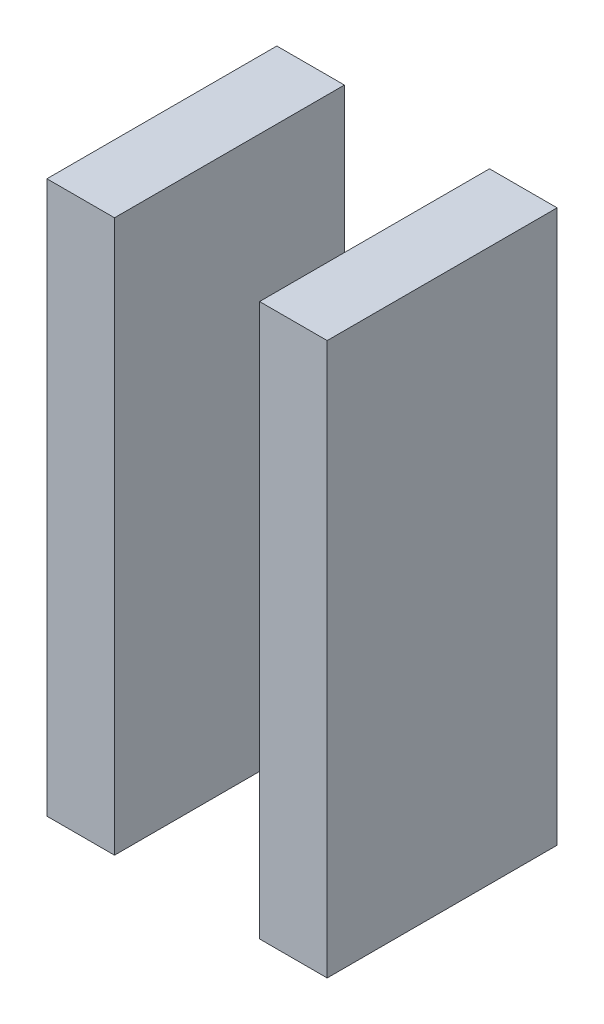
ISO-10303-21;
HEADER;
FILE_DESCRIPTION(('STEP AP214'),'2;1');
FILE_NAME('part.step','',(''),(''),'','','');
FILE_SCHEMA(('AUTOMOTIVE_DESIGN { 1 0 10303 214 1 1 1 1 }'));
ENDSEC;
DATA;
#1=APPLICATION_CONTEXT('core data for automotive mechanical design processes');
#2=APPLICATION_PROTOCOL_DEFINITION('international standard','automotive_design',2000,#1);
#3=PRODUCT_CONTEXT('',#1,'mechanical');
#4=PRODUCT('Part','Part','',(#3));
#5=PRODUCT_RELATED_PRODUCT_CATEGORY('part','',(#4));
#6=PRODUCT_DEFINITION_FORMATION('','',#4);
#7=PRODUCT_DEFINITION_CONTEXT('part definition',#1,'design');
#8=PRODUCT_DEFINITION('design','',#6,#7);
#9=PRODUCT_DEFINITION_SHAPE('','',#8);
#10=(LENGTH_UNIT() NAMED_UNIT(*) SI_UNIT(.MILLI.,.METRE.));
#11=(NAMED_UNIT(*) PLANE_ANGLE_UNIT() SI_UNIT($,.RADIAN.));
#12=(NAMED_UNIT(*) SI_UNIT($,.STERADIAN.) SOLID_ANGLE_UNIT());
#13=UNCERTAINTY_MEASURE_WITH_UNIT(LENGTH_MEASURE(1.E-05),#10,'distance_accuracy_value','');
#14=(GEOMETRIC_REPRESENTATION_CONTEXT(3) GLOBAL_UNCERTAINTY_ASSIGNED_CONTEXT((#13)) GLOBAL_UNIT_ASSIGNED_CONTEXT((#10,
#11,#12)) REPRESENTATION_CONTEXT('',''));
#15=CARTESIAN_POINT('',(0.,0.,0.));
#16=DIRECTION('',(0.,0.,1.));
#17=DIRECTION('',(1.,0.,0.));
#18=AXIS2_PLACEMENT_3D('',#15,#16,#17);
#19=CARTESIAN_POINT('',(204.22,-34.095,11.));
#20=DIRECTION('',(0.,-1.,0.));
#21=DIRECTION('',(0.,0.,-1.));
#22=AXIS2_PLACEMENT_3D('',#19,#20,#21);
#23=PLANE('',#22);
#24=DIRECTION('',(-1.,0.,0.));
#25=VECTOR('',#24,1.);
#26=CARTESIAN_POINT('',(204.22,-34.095,1.));
#27=LINE('',#26,#25);
#28=CARTESIAN_POINT('',(204.22,-34.095,1.));
#29=VERTEX_POINT('',#28);
#30=CARTESIAN_POINT('',(201.28,-34.095,1.));
#31=VERTEX_POINT('',#30);
#32=EDGE_CURVE('E12',#29,#31,#27,.T.);
#33=ORIENTED_EDGE('',*,*,#32,.T.);
#34=DIRECTION('',(0.,0.,-1.));
#35=VECTOR('',#34,1.);
#36=CARTESIAN_POINT('',(201.28,-34.095,11.));
#37=LINE('',#36,#35);
#38=CARTESIAN_POINT('',(201.28,-34.095,11.));
#39=VERTEX_POINT('',#38);
#40=EDGE_CURVE('E118',#39,#31,#37,.T.);
#41=ORIENTED_EDGE('',*,*,#40,.F.);
#42=DIRECTION('',(-1.,0.,0.));
#43=VECTOR('',#42,1.);
#44=CARTESIAN_POINT('',(204.22,-34.095,11.));
#45=LINE('',#44,#43);
#46=CARTESIAN_POINT('',(204.22,-34.095,11.));
#47=VERTEX_POINT('',#46);
#48=EDGE_CURVE('E51',#47,#39,#45,.T.);
#49=ORIENTED_EDGE('',*,*,#48,.F.);
#50=DIRECTION('',(0.,0.,-1.));
#51=VECTOR('',#50,1.);
#52=CARTESIAN_POINT('',(204.22,-34.095,11.));
#53=LINE('',#52,#51);
#54=EDGE_CURVE('E106',#47,#29,#53,.T.);
#55=ORIENTED_EDGE('',*,*,#54,.T.);
#56=EDGE_LOOP('',(#33,#41,#49,#55));
#57=FACE_BOUND('',#56,.T.);
#58=ADVANCED_FACE('F47',(#57),#23,.F.);
#59=CARTESIAN_POINT('',(201.28,-34.095,11.));
#60=DIRECTION('',(1.,0.,0.));
#61=DIRECTION('',(0.,0.,-1.));
#62=AXIS2_PLACEMENT_3D('',#59,#60,#61);
#63=PLANE('',#62);
#64=DIRECTION('',(0.,-1.,0.));
#65=VECTOR('',#64,1.);
#66=CARTESIAN_POINT('',(201.28,-34.095,1.));
#67=LINE('',#66,#65);
#68=CARTESIAN_POINT('',(201.28,-58.105,1.));
#69=VERTEX_POINT('',#68);
#70=EDGE_CURVE('E57',#31,#69,#67,.T.);
#71=ORIENTED_EDGE('',*,*,#70,.T.);
#72=DIRECTION('',(0.,0.,-1.));
#73=VECTOR('',#72,1.);
#74=CARTESIAN_POINT('',(201.28,-58.105,11.));
#75=LINE('',#74,#73);
#76=CARTESIAN_POINT('',(201.28,-58.105,11.));
#77=VERTEX_POINT('',#76);
#78=EDGE_CURVE('E102',#77,#69,#75,.T.);
#79=ORIENTED_EDGE('',*,*,#78,.F.);
#80=DIRECTION('',(0.,-1.,0.));
#81=VECTOR('',#80,1.);
#82=CARTESIAN_POINT('',(201.28,-34.095,11.));
#83=LINE('',#82,#81);
#84=EDGE_CURVE('E81',#39,#77,#83,.T.);
#85=ORIENTED_EDGE('',*,*,#84,.F.);
#86=ORIENTED_EDGE('',*,*,#40,.T.);
#87=EDGE_LOOP('',(#71,#79,#85,#86));
#88=FACE_BOUND('',#87,.T.);
#89=ADVANCED_FACE('F121',(#88),#63,.F.);
#90=CARTESIAN_POINT('',(204.22,-58.105,11.));
#91=DIRECTION('',(0.,1.,0.));
#92=DIRECTION('',(0.,0.,1.));
#93=AXIS2_PLACEMENT_3D('',#90,#91,#92);
#94=PLANE('',#93);
#95=DIRECTION('',(1.,0.,0.));
#96=VECTOR('',#95,1.);
#97=CARTESIAN_POINT('',(204.22,-58.105,1.));
#98=LINE('',#97,#96);
#99=CARTESIAN_POINT('',(204.22,-58.105,1.));
#100=VERTEX_POINT('',#99);
#101=EDGE_CURVE('E97',#69,#100,#98,.T.);
#102=ORIENTED_EDGE('',*,*,#101,.T.);
#103=DIRECTION('',(0.,0.,-1.));
#104=VECTOR('',#103,1.);
#105=CARTESIAN_POINT('',(204.22,-58.105,11.));
#106=LINE('',#105,#104);
#107=CARTESIAN_POINT('',(204.22,-58.105,11.));
#108=VERTEX_POINT('',#107);
#109=EDGE_CURVE('E100',#108,#100,#106,.T.);
#110=ORIENTED_EDGE('',*,*,#109,.F.);
#111=DIRECTION('',(1.,0.,0.));
#112=VECTOR('',#111,1.);
#113=CARTESIAN_POINT('',(204.22,-58.105,11.));
#114=LINE('',#113,#112);
#115=EDGE_CURVE('E114',#77,#108,#114,.T.);
#116=ORIENTED_EDGE('',*,*,#115,.F.);
#117=ORIENTED_EDGE('',*,*,#78,.T.);
#118=EDGE_LOOP('',(#102,#110,#116,#117));
#119=FACE_BOUND('',#118,.T.);
#120=ADVANCED_FACE('F98',(#119),#94,.F.);
#121=CARTESIAN_POINT('',(204.22,-34.095,11.));
#122=DIRECTION('',(-1.,0.,0.));
#123=DIRECTION('',(0.,0.,1.));
#124=AXIS2_PLACEMENT_3D('',#121,#122,#123);
#125=PLANE('',#124);
#126=DIRECTION('',(0.,1.,0.));
#127=VECTOR('',#126,1.);
#128=CARTESIAN_POINT('',(204.22,-34.095,1.));
#129=LINE('',#128,#127);
#130=EDGE_CURVE('E91',#100,#29,#129,.T.);
#131=ORIENTED_EDGE('',*,*,#130,.T.);
#132=ORIENTED_EDGE('',*,*,#54,.F.);
#133=DIRECTION('',(0.,1.,0.));
#134=VECTOR('',#133,1.);
#135=CARTESIAN_POINT('',(204.22,-34.095,11.));
#136=LINE('',#135,#134);
#137=EDGE_CURVE('E105',#108,#47,#136,.T.);
#138=ORIENTED_EDGE('',*,*,#137,.F.);
#139=ORIENTED_EDGE('',*,*,#109,.T.);
#140=EDGE_LOOP('',(#131,#132,#138,#139));
#141=FACE_BOUND('',#140,.T.);
#142=ADVANCED_FACE('F104',(#141),#125,.F.);
#143=CARTESIAN_POINT('',(0.,0.,11.));
#144=DIRECTION('',(0.,0.,1.));
#145=DIRECTION('',(1.,0.,0.));
#146=AXIS2_PLACEMENT_3D('',#143,#144,#145);
#147=PLANE('',#146);
#148=ORIENTED_EDGE('',*,*,#48,.T.);
#149=ORIENTED_EDGE('',*,*,#84,.T.);
#150=ORIENTED_EDGE('',*,*,#115,.T.);
#151=ORIENTED_EDGE('',*,*,#137,.T.);
#152=EDGE_LOOP('',(#148,#149,#150,#151));
#153=FACE_BOUND('',#152,.T.);
#154=ADVANCED_FACE('F49',(#153),#147,.T.);
#155=CARTESIAN_POINT('',(0.,0.,1.));
#156=DIRECTION('',(0.,0.,1.));
#157=DIRECTION('',(1.,0.,0.));
#158=AXIS2_PLACEMENT_3D('',#155,#156,#157);
#159=PLANE('',#158);
#160=ORIENTED_EDGE('',*,*,#32,.F.);
#161=ORIENTED_EDGE('',*,*,#130,.F.);
#162=ORIENTED_EDGE('',*,*,#101,.F.);
#163=ORIENTED_EDGE('',*,*,#70,.F.);
#164=EDGE_LOOP('',(#160,#161,#162,#163));
#165=FACE_BOUND('',#164,.T.);
#166=ADVANCED_FACE('F108',(#165),#159,.F.);
#167=CLOSED_SHELL('',(#58,#89,#120,#142,#154,#166));
#168=MANIFOLD_SOLID_BREP('B2',#167);
#169=CARTESIAN_POINT('',(192.03,-34.095,11.));
#170=DIRECTION('',(1.,0.,0.));
#171=DIRECTION('',(0.,0.,-1.));
#172=AXIS2_PLACEMENT_3D('',#169,#170,#171);
#173=PLANE('',#172);
#174=DIRECTION('',(0.,-1.,0.));
#175=VECTOR('',#174,1.);
#176=CARTESIAN_POINT('',(192.03,-34.095,1.));
#177=LINE('',#176,#175);
#178=CARTESIAN_POINT('',(192.03,-34.095,1.));
#179=VERTEX_POINT('',#178);
#180=CARTESIAN_POINT('',(192.03,-58.105,1.));
#181=VERTEX_POINT('',#180);
#182=EDGE_CURVE('E246',#179,#181,#177,.T.);
#183=ORIENTED_EDGE('',*,*,#182,.T.);
#184=DIRECTION('',(0.,0.,-1.));
#185=VECTOR('',#184,1.);
#186=CARTESIAN_POINT('',(192.03,-58.105,11.));
#187=LINE('',#186,#185);
#188=CARTESIAN_POINT('',(192.03,-58.105,11.));
#189=VERTEX_POINT('',#188);
#190=EDGE_CURVE('E45',#189,#181,#187,.T.);
#191=ORIENTED_EDGE('',*,*,#190,.F.);
#192=DIRECTION('',(0.,-1.,0.));
#193=VECTOR('',#192,1.);
#194=CARTESIAN_POINT('',(192.03,-34.095,11.));
#195=LINE('',#194,#193);
#196=CARTESIAN_POINT('',(192.03,-34.095,11.));
#197=VERTEX_POINT('',#196);
#198=EDGE_CURVE('E234',#197,#189,#195,.T.);
#199=ORIENTED_EDGE('',*,*,#198,.F.);
#200=DIRECTION('',(0.,0.,-1.));
#201=VECTOR('',#200,1.);
#202=CARTESIAN_POINT('',(192.03,-34.095,11.));
#203=LINE('',#202,#201);
#204=EDGE_CURVE('E242',#197,#179,#203,.T.);
#205=ORIENTED_EDGE('',*,*,#204,.T.);
#206=EDGE_LOOP('',(#183,#191,#199,#205));
#207=FACE_BOUND('',#206,.T.);
#208=ADVANCED_FACE('F183',(#207),#173,.F.);
#209=CARTESIAN_POINT('',(192.03,-58.105,11.));
#210=DIRECTION('',(0.,1.,0.));
#211=DIRECTION('',(0.,0.,1.));
#212=AXIS2_PLACEMENT_3D('',#209,#210,#211);
#213=PLANE('',#212);
#214=DIRECTION('',(1.,0.,0.));
#215=VECTOR('',#214,1.);
#216=CARTESIAN_POINT('',(192.03,-58.105,1.));
#217=LINE('',#216,#215);
#218=CARTESIAN_POINT('',(194.97,-58.105,1.));
#219=VERTEX_POINT('',#218);
#220=EDGE_CURVE('E238',#181,#219,#217,.T.);
#221=ORIENTED_EDGE('',*,*,#220,.T.);
#222=DIRECTION('',(0.,0.,-1.));
#223=VECTOR('',#222,1.);
#224=CARTESIAN_POINT('',(194.97,-58.105,11.));
#225=LINE('',#224,#223);
#226=CARTESIAN_POINT('',(194.97,-58.105,11.));
#227=VERTEX_POINT('',#226);
#228=EDGE_CURVE('E191',#227,#219,#225,.T.);
#229=ORIENTED_EDGE('',*,*,#228,.F.);
#230=DIRECTION('',(1.,0.,0.));
#231=VECTOR('',#230,1.);
#232=CARTESIAN_POINT('',(192.03,-58.105,11.));
#233=LINE('',#232,#231);
#234=EDGE_CURVE('E229',#189,#227,#233,.T.);
#235=ORIENTED_EDGE('',*,*,#234,.F.);
#236=ORIENTED_EDGE('',*,*,#190,.T.);
#237=EDGE_LOOP('',(#221,#229,#235,#236));
#238=FACE_BOUND('',#237,.T.);
#239=ADVANCED_FACE('F237',(#238),#213,.F.);
#240=CARTESIAN_POINT('',(194.97,-34.095,11.));
#241=DIRECTION('',(-1.,0.,0.));
#242=DIRECTION('',(0.,0.,1.));
#243=AXIS2_PLACEMENT_3D('',#240,#241,#242);
#244=PLANE('',#243);
#245=DIRECTION('',(0.,1.,0.));
#246=VECTOR('',#245,1.);
#247=CARTESIAN_POINT('',(194.97,-34.095,1.));
#248=LINE('',#247,#246);
#249=CARTESIAN_POINT('',(194.97,-34.095,1.));
#250=VERTEX_POINT('',#249);
#251=EDGE_CURVE('E216',#219,#250,#248,.T.);
#252=ORIENTED_EDGE('',*,*,#251,.T.);
#253=DIRECTION('',(0.,0.,-1.));
#254=VECTOR('',#253,1.);
#255=CARTESIAN_POINT('',(194.97,-34.095,11.));
#256=LINE('',#255,#254);
#257=CARTESIAN_POINT('',(194.97,-34.095,11.));
#258=VERTEX_POINT('',#257);
#259=EDGE_CURVE('E239',#258,#250,#256,.T.);
#260=ORIENTED_EDGE('',*,*,#259,.F.);
#261=DIRECTION('',(0.,1.,0.));
#262=VECTOR('',#261,1.);
#263=CARTESIAN_POINT('',(194.97,-34.095,11.));
#264=LINE('',#263,#262);
#265=EDGE_CURVE('E232',#227,#258,#264,.T.);
#266=ORIENTED_EDGE('',*,*,#265,.F.);
#267=ORIENTED_EDGE('',*,*,#228,.T.);
#268=EDGE_LOOP('',(#252,#260,#266,#267));
#269=FACE_BOUND('',#268,.T.);
#270=ADVANCED_FACE('F240',(#269),#244,.F.);
#271=CARTESIAN_POINT('',(192.03,-34.095,11.));
#272=DIRECTION('',(0.,-1.,0.));
#273=DIRECTION('',(0.,0.,-1.));
#274=AXIS2_PLACEMENT_3D('',#271,#272,#273);
#275=PLANE('',#274);
#276=DIRECTION('',(-1.,0.,0.));
#277=VECTOR('',#276,1.);
#278=CARTESIAN_POINT('',(192.03,-34.095,1.));
#279=LINE('',#278,#277);
#280=EDGE_CURVE('E222',#250,#179,#279,.T.);
#281=ORIENTED_EDGE('',*,*,#280,.T.);
#282=ORIENTED_EDGE('',*,*,#204,.F.);
#283=DIRECTION('',(-1.,0.,0.));
#284=VECTOR('',#283,1.);
#285=CARTESIAN_POINT('',(192.03,-34.095,11.));
#286=LINE('',#285,#284);
#287=EDGE_CURVE('E199',#258,#197,#286,.T.);
#288=ORIENTED_EDGE('',*,*,#287,.F.);
#289=ORIENTED_EDGE('',*,*,#259,.T.);
#290=EDGE_LOOP('',(#281,#282,#288,#289));
#291=FACE_BOUND('',#290,.T.);
#292=ADVANCED_FACE('F253',(#291),#275,.F.);
#293=CARTESIAN_POINT('',(0.,0.,11.));
#294=DIRECTION('',(0.,0.,1.));
#295=DIRECTION('',(1.,0.,0.));
#296=AXIS2_PLACEMENT_3D('',#293,#294,#295);
#297=PLANE('',#296);
#298=ORIENTED_EDGE('',*,*,#198,.T.);
#299=ORIENTED_EDGE('',*,*,#234,.T.);
#300=ORIENTED_EDGE('',*,*,#265,.T.);
#301=ORIENTED_EDGE('',*,*,#287,.T.);
#302=EDGE_LOOP('',(#298,#299,#300,#301));
#303=FACE_BOUND('',#302,.T.);
#304=ADVANCED_FACE('F230',(#303),#297,.T.);
#305=CARTESIAN_POINT('',(0.,0.,1.));
#306=DIRECTION('',(0.,0.,1.));
#307=DIRECTION('',(1.,0.,0.));
#308=AXIS2_PLACEMENT_3D('',#305,#306,#307);
#309=PLANE('',#308);
#310=ORIENTED_EDGE('',*,*,#182,.F.);
#311=ORIENTED_EDGE('',*,*,#280,.F.);
#312=ORIENTED_EDGE('',*,*,#251,.F.);
#313=ORIENTED_EDGE('',*,*,#220,.F.);
#314=EDGE_LOOP('',(#310,#311,#312,#313));
#315=FACE_BOUND('',#314,.T.);
#316=ADVANCED_FACE('F256',(#315),#309,.F.);
#317=CLOSED_SHELL('',(#208,#239,#270,#292,#304,#316));
#318=MANIFOLD_SOLID_BREP('B6',#317);
#319=ADVANCED_BREP_SHAPE_REPRESENTATION('',(#18,#168,#318),#14);
#320=SHAPE_DEFINITION_REPRESENTATION(#9,#319);
ENDSEC;
END-ISO-10303-21;
